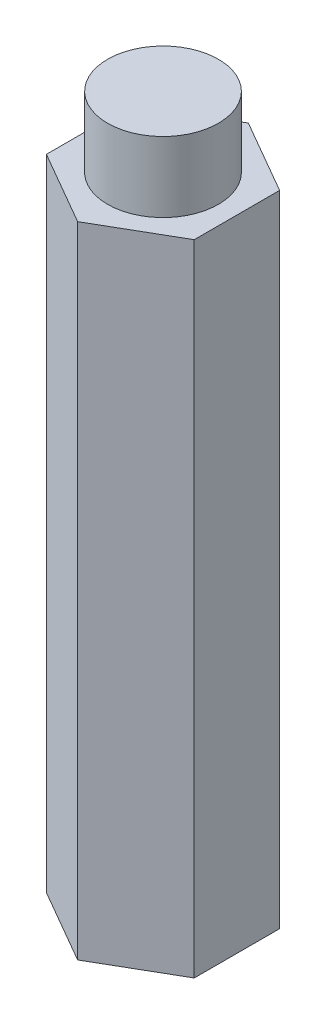
ISO-10303-21;
HEADER;
FILE_DESCRIPTION(('STEP AP214'),'2;1');
FILE_NAME('part.step','',(''),(''),'','','');
FILE_SCHEMA(('AUTOMOTIVE_DESIGN { 1 0 10303 214 1 1 1 1 }'));
ENDSEC;
DATA;
#1=APPLICATION_CONTEXT('core data for automotive mechanical design processes');
#2=APPLICATION_PROTOCOL_DEFINITION('international standard','automotive_design',2000,#1);
#3=PRODUCT_CONTEXT('',#1,'mechanical');
#4=PRODUCT('Part','Part','',(#3));
#5=PRODUCT_RELATED_PRODUCT_CATEGORY('part','',(#4));
#6=PRODUCT_DEFINITION_FORMATION('','',#4);
#7=PRODUCT_DEFINITION_CONTEXT('part definition',#1,'design');
#8=PRODUCT_DEFINITION('design','',#6,#7);
#9=PRODUCT_DEFINITION_SHAPE('','',#8);
#10=(LENGTH_UNIT() NAMED_UNIT(*) SI_UNIT(.MILLI.,.METRE.));
#11=(NAMED_UNIT(*) PLANE_ANGLE_UNIT() SI_UNIT($,.RADIAN.));
#12=(NAMED_UNIT(*) SI_UNIT($,.STERADIAN.) SOLID_ANGLE_UNIT());
#13=UNCERTAINTY_MEASURE_WITH_UNIT(LENGTH_MEASURE(1.E-05),#10,'distance_accuracy_value','');
#14=(GEOMETRIC_REPRESENTATION_CONTEXT(3) GLOBAL_UNCERTAINTY_ASSIGNED_CONTEXT((#13)) GLOBAL_UNIT_ASSIGNED_CONTEXT((#10,
#11,#12)) REPRESENTATION_CONTEXT('',''));
#15=CARTESIAN_POINT('',(0.,0.,0.));
#16=DIRECTION('',(0.,0.,1.));
#17=DIRECTION('',(1.,0.,0.));
#18=AXIS2_PLACEMENT_3D('',#15,#16,#17);
#19=CARTESIAN_POINT('',(0.,54.9275,7.33234841870825));
#20=DIRECTION('',(-0.5,0.,-0.866025403784439));
#21=DIRECTION('',(-0.866025403784439,0.,0.5));
#22=AXIS2_PLACEMENT_3D('',#19,#20,#21);
#23=PLANE('',#22);
#24=DIRECTION('',(0.866025403784438,0.,-0.5));
#25=VECTOR('',#24,1.);
#26=CARTESIAN_POINT('',(0.,0.,7.33234841870825));
#27=LINE('',#26,#25);
#28=CARTESIAN_POINT('',(0.,0.,7.33234841870825));
#29=VERTEX_POINT('',#28);
#30=CARTESIAN_POINT('',(6.35,0.,3.66617420935412));
#31=VERTEX_POINT('',#30);
#32=EDGE_CURVE('E117',#29,#31,#27,.T.);
#33=ORIENTED_EDGE('',*,*,#32,.T.);
#34=DIRECTION('',(0.,-1.,0.));
#35=VECTOR('',#34,1.);
#36=CARTESIAN_POINT('',(6.35,54.9275,3.66617420935412));
#37=LINE('',#36,#35);
#38=CARTESIAN_POINT('',(6.35,54.9275,3.66617420935412));
#39=VERTEX_POINT('',#38);
#40=EDGE_CURVE('E11',#39,#31,#37,.T.);
#41=ORIENTED_EDGE('',*,*,#40,.F.);
#42=DIRECTION('',(0.866025403784438,0.,-0.5));
#43=VECTOR('',#42,1.);
#44=CARTESIAN_POINT('',(0.,54.9275,7.33234841870825));
#45=LINE('',#44,#43);
#46=CARTESIAN_POINT('',(0.,54.9275,7.33234841870825));
#47=VERTEX_POINT('',#46);
#48=EDGE_CURVE('E128',#47,#39,#45,.T.);
#49=ORIENTED_EDGE('',*,*,#48,.F.);
#50=DIRECTION('',(0.,-1.,0.));
#51=VECTOR('',#50,1.);
#52=CARTESIAN_POINT('',(0.,54.9275,7.33234841870825));
#53=LINE('',#52,#51);
#54=EDGE_CURVE('E113',#47,#29,#53,.T.);
#55=ORIENTED_EDGE('',*,*,#54,.T.);
#56=EDGE_LOOP('',(#33,#41,#49,#55));
#57=FACE_BOUND('',#56,.T.);
#58=ADVANCED_FACE('F33',(#57),#23,.F.);
#59=CARTESIAN_POINT('',(6.35,54.9275,3.66617420935412));
#60=DIRECTION('',(-1.,0.,0.));
#61=DIRECTION('',(0.,0.,1.));
#62=AXIS2_PLACEMENT_3D('',#59,#60,#61);
#63=PLANE('',#62);
#64=DIRECTION('',(0.,0.,-1.));
#65=VECTOR('',#64,1.);
#66=CARTESIAN_POINT('',(6.35,0.,3.66617420935412));
#67=LINE('',#66,#65);
#68=CARTESIAN_POINT('',(6.35,0.,-3.66617420935412));
#69=VERTEX_POINT('',#68);
#70=EDGE_CURVE('E120',#31,#69,#67,.T.);
#71=ORIENTED_EDGE('',*,*,#70,.T.);
#72=DIRECTION('',(0.,-1.,0.));
#73=VECTOR('',#72,1.);
#74=CARTESIAN_POINT('',(6.35,54.9275,-3.66617420935412));
#75=LINE('',#74,#73);
#76=CARTESIAN_POINT('',(6.35,54.9275,-3.66617420935412));
#77=VERTEX_POINT('',#76);
#78=EDGE_CURVE('E41',#77,#69,#75,.T.);
#79=ORIENTED_EDGE('',*,*,#78,.F.);
#80=DIRECTION('',(0.,0.,-1.));
#81=VECTOR('',#80,1.);
#82=CARTESIAN_POINT('',(6.35,54.9275,3.66617420935412));
#83=LINE('',#82,#81);
#84=EDGE_CURVE('E86',#39,#77,#83,.T.);
#85=ORIENTED_EDGE('',*,*,#84,.F.);
#86=ORIENTED_EDGE('',*,*,#40,.T.);
#87=EDGE_LOOP('',(#71,#79,#85,#86));
#88=FACE_BOUND('',#87,.T.);
#89=ADVANCED_FACE('F153',(#88),#63,.F.);
#90=CARTESIAN_POINT('',(6.35,54.9275,-3.66617420935412));
#91=DIRECTION('',(-0.5,0.,0.866025403784439));
#92=DIRECTION('',(0.866025403784439,0.,0.5));
#93=AXIS2_PLACEMENT_3D('',#90,#91,#92);
#94=PLANE('',#93);
#95=DIRECTION('',(-0.866025403784439,0.,-0.5));
#96=VECTOR('',#95,1.);
#97=CARTESIAN_POINT('',(6.35,0.,-3.66617420935412));
#98=LINE('',#97,#96);
#99=CARTESIAN_POINT('',(0.,0.,-7.33234841870825));
#100=VERTEX_POINT('',#99);
#101=EDGE_CURVE('E123',#69,#100,#98,.T.);
#102=ORIENTED_EDGE('',*,*,#101,.T.);
#103=DIRECTION('',(0.,-1.,0.));
#104=VECTOR('',#103,1.);
#105=CARTESIAN_POINT('',(0.,54.9275,-7.33234841870825));
#106=LINE('',#105,#104);
#107=CARTESIAN_POINT('',(0.,54.9275,-7.33234841870825));
#108=VERTEX_POINT('',#107);
#109=EDGE_CURVE('E108',#108,#100,#106,.T.);
#110=ORIENTED_EDGE('',*,*,#109,.F.);
#111=DIRECTION('',(-0.866025403784439,0.,-0.5));
#112=VECTOR('',#111,1.);
#113=CARTESIAN_POINT('',(6.35,54.9275,-3.66617420935412));
#114=LINE('',#113,#112);
#115=EDGE_CURVE('E99',#77,#108,#114,.T.);
#116=ORIENTED_EDGE('',*,*,#115,.F.);
#117=ORIENTED_EDGE('',*,*,#78,.T.);
#118=EDGE_LOOP('',(#102,#110,#116,#117));
#119=FACE_BOUND('',#118,.T.);
#120=ADVANCED_FACE('F134',(#119),#94,.F.);
#121=CARTESIAN_POINT('',(0.,54.9275,-7.33234841870825));
#122=DIRECTION('',(0.5,0.,0.866025403784439));
#123=DIRECTION('',(0.866025403784439,0.,-0.5));
#124=AXIS2_PLACEMENT_3D('',#121,#122,#123);
#125=PLANE('',#124);
#126=DIRECTION('',(-0.866025403784438,0.,0.5));
#127=VECTOR('',#126,1.);
#128=CARTESIAN_POINT('',(0.,0.,-7.33234841870825));
#129=LINE('',#128,#127);
#130=CARTESIAN_POINT('',(-6.35,0.,-3.66617420935412));
#131=VERTEX_POINT('',#130);
#132=EDGE_CURVE('E107',#100,#131,#129,.T.);
#133=ORIENTED_EDGE('',*,*,#132,.T.);
#134=DIRECTION('',(0.,-1.,0.));
#135=VECTOR('',#134,1.);
#136=CARTESIAN_POINT('',(-6.35,54.9275,-3.66617420935412));
#137=LINE('',#136,#135);
#138=CARTESIAN_POINT('',(-6.35,54.9275,-3.66617420935412));
#139=VERTEX_POINT('',#138);
#140=EDGE_CURVE('E104',#139,#131,#137,.T.);
#141=ORIENTED_EDGE('',*,*,#140,.F.);
#142=DIRECTION('',(-0.866025403784438,0.,0.5));
#143=VECTOR('',#142,1.);
#144=CARTESIAN_POINT('',(0.,54.9275,-7.33234841870825));
#145=LINE('',#144,#143);
#146=EDGE_CURVE('E93',#108,#139,#145,.T.);
#147=ORIENTED_EDGE('',*,*,#146,.F.);
#148=ORIENTED_EDGE('',*,*,#109,.T.);
#149=EDGE_LOOP('',(#133,#141,#147,#148));
#150=FACE_BOUND('',#149,.T.);
#151=ADVANCED_FACE('F105',(#150),#125,.F.);
#152=CARTESIAN_POINT('',(-6.35,54.9275,-3.66617420935412));
#153=DIRECTION('',(1.,0.,0.));
#154=DIRECTION('',(0.,0.,-1.));
#155=AXIS2_PLACEMENT_3D('',#152,#153,#154);
#156=PLANE('',#155);
#157=DIRECTION('',(0.,0.,1.));
#158=VECTOR('',#157,1.);
#159=CARTESIAN_POINT('',(-6.35,0.,-3.66617420935412));
#160=LINE('',#159,#158);
#161=CARTESIAN_POINT('',(-6.35,0.,3.66617420935412));
#162=VERTEX_POINT('',#161);
#163=EDGE_CURVE('E72',#131,#162,#160,.T.);
#164=ORIENTED_EDGE('',*,*,#163,.T.);
#165=DIRECTION('',(0.,-1.,0.));
#166=VECTOR('',#165,1.);
#167=CARTESIAN_POINT('',(-6.35,54.9275,3.66617420935412));
#168=LINE('',#167,#166);
#169=CARTESIAN_POINT('',(-6.35,54.9275,3.66617420935412));
#170=VERTEX_POINT('',#169);
#171=EDGE_CURVE('E109',#170,#162,#168,.T.);
#172=ORIENTED_EDGE('',*,*,#171,.F.);
#173=DIRECTION('',(0.,0.,1.));
#174=VECTOR('',#173,1.);
#175=CARTESIAN_POINT('',(-6.35,54.9275,-3.66617420935412));
#176=LINE('',#175,#174);
#177=EDGE_CURVE('E97',#139,#170,#176,.T.);
#178=ORIENTED_EDGE('',*,*,#177,.F.);
#179=ORIENTED_EDGE('',*,*,#140,.T.);
#180=EDGE_LOOP('',(#164,#172,#178,#179));
#181=FACE_BOUND('',#180,.T.);
#182=ADVANCED_FACE('F111',(#181),#156,.F.);
#183=CARTESIAN_POINT('',(-6.35,54.9275,3.66617420935412));
#184=DIRECTION('',(0.5,0.,-0.866025403784439));
#185=DIRECTION('',(-0.866025403784439,0.,-0.5));
#186=AXIS2_PLACEMENT_3D('',#183,#184,#185);
#187=PLANE('',#186);
#188=DIRECTION('',(0.866025403784439,0.,0.5));
#189=VECTOR('',#188,1.);
#190=CARTESIAN_POINT('',(-6.35,0.,3.66617420935412));
#191=LINE('',#190,#189);
#192=EDGE_CURVE('E78',#162,#29,#191,.T.);
#193=ORIENTED_EDGE('',*,*,#192,.T.);
#194=ORIENTED_EDGE('',*,*,#54,.F.);
#195=DIRECTION('',(0.866025403784439,0.,0.5));
#196=VECTOR('',#195,1.);
#197=CARTESIAN_POINT('',(-6.35,54.9275,3.66617420935412));
#198=LINE('',#197,#196);
#199=EDGE_CURVE('E49',#170,#47,#198,.T.);
#200=ORIENTED_EDGE('',*,*,#199,.F.);
#201=ORIENTED_EDGE('',*,*,#171,.T.);
#202=EDGE_LOOP('',(#193,#194,#200,#201));
#203=FACE_BOUND('',#202,.T.);
#204=ADVANCED_FACE('F141',(#203),#187,.F.);
#205=CARTESIAN_POINT('',(0.,54.9275,0.));
#206=DIRECTION('',(0.,1.,0.));
#207=DIRECTION('',(0.,0.,1.));
#208=AXIS2_PLACEMENT_3D('',#205,#206,#207);
#209=PLANE('',#208);
#210=CARTESIAN_POINT('',(0.,54.9275,0.));
#211=DIRECTION('',(0.,1.,0.));
#212=DIRECTION('',(0.,0.,1.));
#213=AXIS2_PLACEMENT_3D('',#210,#211,#212);
#214=CIRCLE('',#213,4.7625);
#215=CARTESIAN_POINT('',(0.,54.9275,4.7625));
#216=VERTEX_POINT('',#215);
#217=EDGE_CURVE('E121',#216,#216,#214,.F.);
#218=ORIENTED_EDGE('',*,*,#217,.T.);
#219=EDGE_LOOP('',(#218));
#220=FACE_BOUND('',#219,.T.);
#221=ORIENTED_EDGE('',*,*,#48,.T.);
#222=ORIENTED_EDGE('',*,*,#84,.T.);
#223=ORIENTED_EDGE('',*,*,#115,.T.);
#224=ORIENTED_EDGE('',*,*,#146,.T.);
#225=ORIENTED_EDGE('',*,*,#177,.T.);
#226=ORIENTED_EDGE('',*,*,#199,.T.);
#227=EDGE_LOOP('',(#221,#222,#223,#224,#225,#226));
#228=FACE_BOUND('',#227,.T.);
#229=ADVANCED_FACE('F95',(#220,#228),#209,.T.);
#230=CARTESIAN_POINT('',(0.,0.,0.));
#231=DIRECTION('',(0.,1.,0.));
#232=DIRECTION('',(0.,0.,1.));
#233=AXIS2_PLACEMENT_3D('',#230,#231,#232);
#234=PLANE('',#233);
#235=ORIENTED_EDGE('',*,*,#32,.F.);
#236=ORIENTED_EDGE('',*,*,#192,.F.);
#237=ORIENTED_EDGE('',*,*,#163,.F.);
#238=ORIENTED_EDGE('',*,*,#132,.F.);
#239=ORIENTED_EDGE('',*,*,#101,.F.);
#240=ORIENTED_EDGE('',*,*,#70,.F.);
#241=EDGE_LOOP('',(#235,#236,#237,#238,#239,#240));
#242=FACE_BOUND('',#241,.T.);
#243=ADVANCED_FACE('F137',(#242),#234,.F.);
#244=CARTESIAN_POINT('',(0.,60.96,0.));
#245=DIRECTION('',(0.,-1.,0.));
#246=DIRECTION('',(0.,0.,-1.));
#247=AXIS2_PLACEMENT_3D('',#244,#245,#246);
#248=CYLINDRICAL_SURFACE('',#247,4.7625);
#249=ORIENTED_EDGE('',*,*,#217,.F.);
#250=EDGE_LOOP('',(#249));
#251=FACE_BOUND('',#250,.T.);
#252=CARTESIAN_POINT('',(0.,60.96,0.));
#253=DIRECTION('',(0.,1.,0.));
#254=DIRECTION('',(0.,0.,1.));
#255=AXIS2_PLACEMENT_3D('',#252,#253,#254);
#256=CIRCLE('',#255,4.7625);
#257=CARTESIAN_POINT('',(0.,60.96,4.7625));
#258=VERTEX_POINT('',#257);
#259=EDGE_CURVE('E214',#258,#258,#256,.T.);
#260=ORIENTED_EDGE('',*,*,#259,.F.);
#261=EDGE_LOOP('',(#260));
#262=FACE_BOUND('',#261,.T.);
#263=ADVANCED_FACE('F190',(#251,#262),#248,.T.);
#264=CARTESIAN_POINT('',(0.,60.96,0.));
#265=DIRECTION('',(0.,1.,0.));
#266=DIRECTION('',(0.,0.,1.));
#267=AXIS2_PLACEMENT_3D('',#264,#265,#266);
#268=PLANE('',#267);
#269=ORIENTED_EDGE('',*,*,#259,.T.);
#270=EDGE_LOOP('',(#269));
#271=FACE_BOUND('',#270,.T.);
#272=ADVANCED_FACE('F198',(#271),#268,.T.);
#273=CLOSED_SHELL('',(#58,#89,#120,#151,#182,#204,#229,#243,#263,#272));
#274=MANIFOLD_SOLID_BREP('B2',#273);
#275=ADVANCED_BREP_SHAPE_REPRESENTATION('',(#18,#274),#14);
#276=SHAPE_DEFINITION_REPRESENTATION(#9,#275);
ENDSEC;
END-ISO-10303-21;
